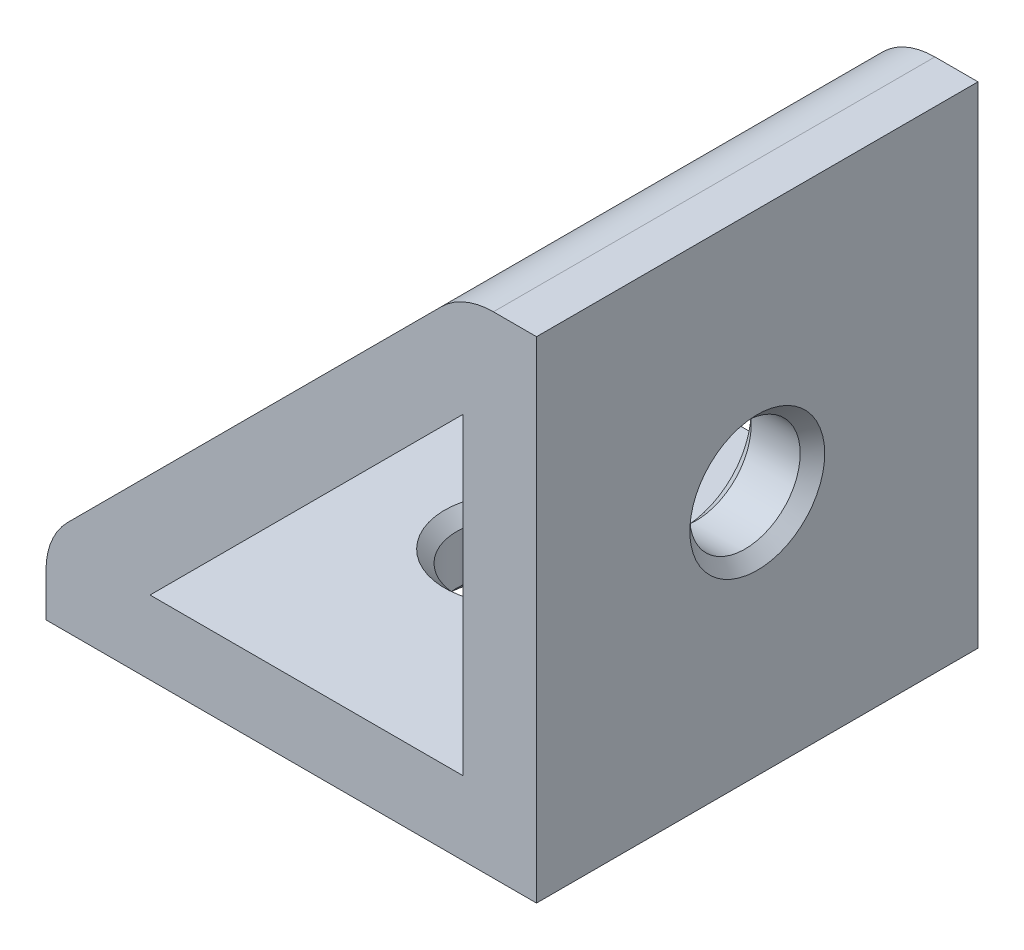
ISO-10303-21;
HEADER;
FILE_DESCRIPTION(('STEP AP214'),'2;1');
FILE_NAME('part.step','',(''),(''),'','','');
FILE_SCHEMA(('AUTOMOTIVE_DESIGN { 1 0 10303 214 1 1 1 1 }'));
ENDSEC;
DATA;
#1=APPLICATION_CONTEXT('core data for automotive mechanical design processes');
#2=APPLICATION_PROTOCOL_DEFINITION('international standard','automotive_design',2000,#1);
#3=PRODUCT_CONTEXT('',#1,'mechanical');
#4=PRODUCT('Part','Part','',(#3));
#5=PRODUCT_RELATED_PRODUCT_CATEGORY('part','',(#4));
#6=PRODUCT_DEFINITION_FORMATION('','',#4);
#7=PRODUCT_DEFINITION_CONTEXT('part definition',#1,'design');
#8=PRODUCT_DEFINITION('design','',#6,#7);
#9=PRODUCT_DEFINITION_SHAPE('','',#8);
#10=(LENGTH_UNIT() NAMED_UNIT(*) SI_UNIT(.MILLI.,.METRE.));
#11=(NAMED_UNIT(*) PLANE_ANGLE_UNIT() SI_UNIT($,.RADIAN.));
#12=(NAMED_UNIT(*) SI_UNIT($,.STERADIAN.) SOLID_ANGLE_UNIT());
#13=UNCERTAINTY_MEASURE_WITH_UNIT(LENGTH_MEASURE(1.E-05),#10,'distance_accuracy_value','');
#14=(GEOMETRIC_REPRESENTATION_CONTEXT(3) GLOBAL_UNCERTAINTY_ASSIGNED_CONTEXT((#13)) GLOBAL_UNIT_ASSIGNED_CONTEXT((#10,
#11,#12)) REPRESENTATION_CONTEXT('',''));
#15=CARTESIAN_POINT('',(0.,0.,0.));
#16=DIRECTION('',(0.,0.,1.));
#17=DIRECTION('',(1.,0.,0.));
#18=AXIS2_PLACEMENT_3D('',#15,#16,#17);
#19=CARTESIAN_POINT('',(-40.,0.,-36.));
#20=DIRECTION('',(0.,-1.,0.));
#21=DIRECTION('',(0.,0.,-1.));
#22=AXIS2_PLACEMENT_3D('',#19,#20,#21);
#23=PLANE('',#22);
#24=CARTESIAN_POINT('',(-20.,0.,-18.));
#25=DIRECTION('',(0.,-1.,0.));
#26=DIRECTION('',(0.,0.,-1.));
#27=AXIS2_PLACEMENT_3D('',#24,#25,#26);
#28=CIRCLE('',#27,5.5);
#29=CARTESIAN_POINT('',(-20.,0.,-23.5));
#30=VERTEX_POINT('',#29);
#31=EDGE_CURVE('E248',#30,#30,#28,.F.);
#32=ORIENTED_EDGE('',*,*,#31,.T.);
#33=EDGE_LOOP('',(#32));
#34=FACE_BOUND('',#33,.T.);
#35=DIRECTION('',(1.,0.,0.));
#36=VECTOR('',#35,1.);
#37=CARTESIAN_POINT('',(-40.,0.,0.));
#38=LINE('',#37,#36);
#39=CARTESIAN_POINT('',(-40.,0.,0.));
#40=VERTEX_POINT('',#39);
#41=CARTESIAN_POINT('',(0.,0.,0.));
#42=VERTEX_POINT('',#41);
#43=EDGE_CURVE('E182',#40,#42,#38,.T.);
#44=ORIENTED_EDGE('',*,*,#43,.F.);
#45=DIRECTION('',(0.,0.,1.));
#46=VECTOR('',#45,1.);
#47=CARTESIAN_POINT('',(-40.,0.,-36.));
#48=LINE('',#47,#46);
#49=CARTESIAN_POINT('',(-40.,0.,-36.));
#50=VERTEX_POINT('',#49);
#51=EDGE_CURVE('E212',#50,#40,#48,.T.);
#52=ORIENTED_EDGE('',*,*,#51,.F.);
#53=DIRECTION('',(1.,0.,0.));
#54=VECTOR('',#53,1.);
#55=CARTESIAN_POINT('',(-40.,0.,-36.));
#56=LINE('',#55,#54);
#57=CARTESIAN_POINT('',(0.,0.,-36.));
#58=VERTEX_POINT('',#57);
#59=EDGE_CURVE('E184',#50,#58,#56,.T.);
#60=ORIENTED_EDGE('',*,*,#59,.T.);
#61=DIRECTION('',(0.,0.,1.));
#62=VECTOR('',#61,1.);
#63=CARTESIAN_POINT('',(0.,0.,-36.));
#64=LINE('',#63,#62);
#65=EDGE_CURVE('E199',#58,#42,#64,.T.);
#66=ORIENTED_EDGE('',*,*,#65,.T.);
#67=EDGE_LOOP('',(#44,#52,#60,#66));
#68=FACE_BOUND('',#67,.T.);
#69=ADVANCED_FACE('F16',(#34,#68),#23,.T.);
#70=CARTESIAN_POINT('',(-40.,0.,-36.));
#71=DIRECTION('',(-1.,0.,0.));
#72=DIRECTION('',(0.,0.,1.));
#73=AXIS2_PLACEMENT_3D('',#70,#71,#72);
#74=PLANE('',#73);
#75=DIRECTION('',(0.,-1.,0.));
#76=VECTOR('',#75,1.);
#77=CARTESIAN_POINT('',(-40.,0.,0.));
#78=LINE('',#77,#76);
#79=CARTESIAN_POINT('',(-40.,3.51471862576143,0.));
#80=VERTEX_POINT('',#79);
#81=EDGE_CURVE('E188',#80,#40,#78,.T.);
#82=ORIENTED_EDGE('',*,*,#81,.F.);
#83=DIRECTION('',(0.,0.,1.));
#84=VECTOR('',#83,1.);
#85=CARTESIAN_POINT('',(-40.,3.51471862576143,-36.));
#86=LINE('',#85,#84);
#87=CARTESIAN_POINT('',(-40.,3.51471862576143,-36.));
#88=VERTEX_POINT('',#87);
#89=EDGE_CURVE('E234',#80,#88,#86,.F.);
#90=ORIENTED_EDGE('',*,*,#89,.T.);
#91=DIRECTION('',(0.,-1.,0.));
#92=VECTOR('',#91,1.);
#93=CARTESIAN_POINT('',(-40.,0.,-36.));
#94=LINE('',#93,#92);
#95=EDGE_CURVE('E197',#88,#50,#94,.T.);
#96=ORIENTED_EDGE('',*,*,#95,.T.);
#97=ORIENTED_EDGE('',*,*,#51,.T.);
#98=EDGE_LOOP('',(#82,#90,#96,#97));
#99=FACE_BOUND('',#98,.T.);
#100=ADVANCED_FACE('F374',(#99),#74,.T.);
#101=CARTESIAN_POINT('',(-40.,6.,-36.));
#102=DIRECTION('',(-0.707106781186547,0.707106781186547,0.));
#103=DIRECTION('',(-0.707106781186548,-0.707106781186548,0.));
#104=AXIS2_PLACEMENT_3D('',#101,#102,#103);
#105=PLANE('',#104);
#106=DIRECTION('',(0.707106781186548,0.707106781186548,0.));
#107=VECTOR('',#106,1.);
#108=CARTESIAN_POINT('',(-20.1715728752538,25.8284271247462,-32.));
#109=LINE('',#108,#107);
#110=CARTESIAN_POINT('',(-25.8284271247462,20.1715728752538,-32.));
#111=VERTEX_POINT('',#110);
#112=CARTESIAN_POINT('',(-20.1715728752538,25.8284271247462,-32.));
#113=VERTEX_POINT('',#112);
#114=EDGE_CURVE('E295',#111,#113,#109,.T.);
#115=ORIENTED_EDGE('',*,*,#114,.T.);
#116=CARTESIAN_POINT('',(-20.1715728752538,25.8284271247462,-18.));
#117=DIRECTION('',(-0.707106781186547,0.707106781186547,0.));
#118=DIRECTION('',(-0.707106781186548,-0.707106781186548,0.));
#119=AXIS2_PLACEMENT_3D('',#116,#117,#118);
#120=CIRCLE('',#119,14.);
#121=CARTESIAN_POINT('',(-20.1715728752538,25.8284271247462,-4.00000000000002));
#122=VERTEX_POINT('',#121);
#123=EDGE_CURVE('E297',#113,#122,#120,.F.);
#124=ORIENTED_EDGE('',*,*,#123,.T.);
#125=DIRECTION('',(-0.707106781186548,-0.707106781186548,0.));
#126=VECTOR('',#125,1.);
#127=CARTESIAN_POINT('',(-25.8284271247462,20.1715728752538,-4.00000000000002));
#128=LINE('',#127,#126);
#129=CARTESIAN_POINT('',(-25.8284271247462,20.1715728752538,-4.00000000000002));
#130=VERTEX_POINT('',#129);
#131=EDGE_CURVE('E293',#122,#130,#128,.T.);
#132=ORIENTED_EDGE('',*,*,#131,.T.);
#133=CARTESIAN_POINT('',(-25.8284271247462,20.1715728752538,-18.));
#134=DIRECTION('',(-0.707106781186547,0.707106781186547,0.));
#135=DIRECTION('',(-0.707106781186548,-0.707106781186548,0.));
#136=AXIS2_PLACEMENT_3D('',#133,#134,#135);
#137=CIRCLE('',#136,14.);
#138=EDGE_CURVE('E291',#130,#111,#137,.F.);
#139=ORIENTED_EDGE('',*,*,#138,.T.);
#140=EDGE_LOOP('',(#115,#124,#132,#139));
#141=FACE_BOUND('',#140,.T.);
#142=DIRECTION('',(-0.707106781186547,-0.707106781186547,0.));
#143=VECTOR('',#142,1.);
#144=CARTESIAN_POINT('',(-40.,6.,0.));
#145=LINE('',#144,#143);
#146=CARTESIAN_POINT('',(-7.75735931288072,38.2426406871193,0.));
#147=VERTEX_POINT('',#146);
#148=CARTESIAN_POINT('',(-38.2426406871193,7.75735931288071,0.));
#149=VERTEX_POINT('',#148);
#150=EDGE_CURVE('E208',#147,#149,#145,.T.);
#151=ORIENTED_EDGE('',*,*,#150,.F.);
#152=DIRECTION('',(0.,0.,1.));
#153=VECTOR('',#152,1.);
#154=CARTESIAN_POINT('',(-7.75735931288071,38.2426406871193,-36.));
#155=LINE('',#154,#153);
#156=CARTESIAN_POINT('',(-7.75735931288072,38.2426406871193,-36.));
#157=VERTEX_POINT('',#156);
#158=EDGE_CURVE('E228',#147,#157,#155,.F.);
#159=ORIENTED_EDGE('',*,*,#158,.T.);
#160=DIRECTION('',(-0.707106781186547,-0.707106781186547,0.));
#161=VECTOR('',#160,1.);
#162=CARTESIAN_POINT('',(-40.,6.,-36.));
#163=LINE('',#162,#161);
#164=CARTESIAN_POINT('',(-38.2426406871193,7.75735931288071,-36.));
#165=VERTEX_POINT('',#164);
#166=EDGE_CURVE('E194',#157,#165,#163,.T.);
#167=ORIENTED_EDGE('',*,*,#166,.T.);
#168=DIRECTION('',(0.,0.,1.));
#169=VECTOR('',#168,1.);
#170=CARTESIAN_POINT('',(-38.2426406871193,7.75735931288071,-36.));
#171=LINE('',#170,#169);
#172=EDGE_CURVE('E225',#165,#149,#171,.T.);
#173=ORIENTED_EDGE('',*,*,#172,.T.);
#174=EDGE_LOOP('',(#151,#159,#167,#173));
#175=FACE_BOUND('',#174,.T.);
#176=ADVANCED_FACE('F320',(#141,#175),#105,.T.);
#177=CARTESIAN_POINT('',(0.,40.,-36.));
#178=DIRECTION('',(0.,1.,0.));
#179=DIRECTION('',(0.,0.,1.));
#180=AXIS2_PLACEMENT_3D('',#177,#178,#179);
#181=PLANE('',#180);
#182=DIRECTION('',(-1.,0.,0.));
#183=VECTOR('',#182,1.);
#184=CARTESIAN_POINT('',(0.,40.,-36.));
#185=LINE('',#184,#183);
#186=CARTESIAN_POINT('',(0.,40.,-36.));
#187=VERTEX_POINT('',#186);
#188=CARTESIAN_POINT('',(-3.51471862576143,40.,-36.));
#189=VERTEX_POINT('',#188);
#190=EDGE_CURVE('E191',#187,#189,#185,.T.);
#191=ORIENTED_EDGE('',*,*,#190,.T.);
#192=DIRECTION('',(0.,0.,1.));
#193=VECTOR('',#192,1.);
#194=CARTESIAN_POINT('',(-3.51471862576143,40.,-36.));
#195=LINE('',#194,#193);
#196=CARTESIAN_POINT('',(-3.51471862576143,40.,0.));
#197=VERTEX_POINT('',#196);
#198=EDGE_CURVE('E215',#189,#197,#195,.T.);
#199=ORIENTED_EDGE('',*,*,#198,.T.);
#200=DIRECTION('',(-1.,0.,0.));
#201=VECTOR('',#200,1.);
#202=CARTESIAN_POINT('',(0.,40.,0.));
#203=LINE('',#202,#201);
#204=CARTESIAN_POINT('',(0.,40.,0.));
#205=VERTEX_POINT('',#204);
#206=EDGE_CURVE('E205',#205,#197,#203,.T.);
#207=ORIENTED_EDGE('',*,*,#206,.F.);
#208=DIRECTION('',(0.,0.,1.));
#209=VECTOR('',#208,1.);
#210=CARTESIAN_POINT('',(0.,40.,-36.));
#211=LINE('',#210,#209);
#212=EDGE_CURVE('E216',#187,#205,#211,.T.);
#213=ORIENTED_EDGE('',*,*,#212,.F.);
#214=EDGE_LOOP('',(#191,#199,#207,#213));
#215=FACE_BOUND('',#214,.T.);
#216=ADVANCED_FACE('F626',(#215),#181,.T.);
#217=CARTESIAN_POINT('',(0.,0.,-36.));
#218=DIRECTION('',(1.,0.,0.));
#219=DIRECTION('',(0.,0.,-1.));
#220=AXIS2_PLACEMENT_3D('',#217,#218,#219);
#221=PLANE('',#220);
#222=CARTESIAN_POINT('',(0.,20.,-18.));
#223=DIRECTION('',(1.,0.,0.));
#224=DIRECTION('',(0.,0.,-1.));
#225=AXIS2_PLACEMENT_3D('',#222,#223,#224);
#226=CIRCLE('',#225,5.50000000000001);
#227=CARTESIAN_POINT('',(0.,20.,-23.5));
#228=VERTEX_POINT('',#227);
#229=EDGE_CURVE('E242',#228,#228,#226,.F.);
#230=ORIENTED_EDGE('',*,*,#229,.T.);
#231=EDGE_LOOP('',(#230));
#232=FACE_BOUND('',#231,.T.);
#233=DIRECTION('',(0.,1.,0.));
#234=VECTOR('',#233,1.);
#235=CARTESIAN_POINT('',(0.,0.,0.));
#236=LINE('',#235,#234);
#237=EDGE_CURVE('E202',#42,#205,#236,.T.);
#238=ORIENTED_EDGE('',*,*,#237,.F.);
#239=ORIENTED_EDGE('',*,*,#65,.F.);
#240=DIRECTION('',(0.,1.,0.));
#241=VECTOR('',#240,1.);
#242=CARTESIAN_POINT('',(0.,0.,-36.));
#243=LINE('',#242,#241);
#244=EDGE_CURVE('E187',#58,#187,#243,.T.);
#245=ORIENTED_EDGE('',*,*,#244,.T.);
#246=ORIENTED_EDGE('',*,*,#212,.T.);
#247=EDGE_LOOP('',(#238,#239,#245,#246));
#248=FACE_BOUND('',#247,.T.);
#249=ADVANCED_FACE('F385',(#232,#248),#221,.T.);
#250=CARTESIAN_POINT('',(0.,0.,-36.));
#251=DIRECTION('',(0.,0.,1.));
#252=DIRECTION('',(1.,0.,0.));
#253=AXIS2_PLACEMENT_3D('',#250,#251,#252);
#254=PLANE('',#253);
#255=DIRECTION('',(0.,1.,0.));
#256=VECTOR('',#255,1.);
#257=CARTESIAN_POINT('',(-6.,6.,-36.));
#258=LINE('',#257,#256);
#259=CARTESIAN_POINT('',(-6.,6.,-36.));
#260=VERTEX_POINT('',#259);
#261=CARTESIAN_POINT('',(-6.,31.5147186257614,-36.));
#262=VERTEX_POINT('',#261);
#263=EDGE_CURVE('E157',#260,#262,#258,.T.);
#264=ORIENTED_EDGE('',*,*,#263,.T.);
#265=DIRECTION('',(-0.707106781186547,-0.707106781186548,0.));
#266=VECTOR('',#265,1.);
#267=CARTESIAN_POINT('',(-6.,31.5147186257614,-36.));
#268=LINE('',#267,#266);
#269=CARTESIAN_POINT('',(-31.5147186257614,6.,-36.));
#270=VERTEX_POINT('',#269);
#271=EDGE_CURVE('E149',#262,#270,#268,.T.);
#272=ORIENTED_EDGE('',*,*,#271,.T.);
#273=DIRECTION('',(1.,0.,0.));
#274=VECTOR('',#273,1.);
#275=CARTESIAN_POINT('',(-31.5147186257614,6.,-36.));
#276=LINE('',#275,#274);
#277=EDGE_CURVE('E161',#270,#260,#276,.T.);
#278=ORIENTED_EDGE('',*,*,#277,.T.);
#279=EDGE_LOOP('',(#264,#272,#278));
#280=FACE_BOUND('',#279,.T.);
#281=ORIENTED_EDGE('',*,*,#166,.F.);
#282=CARTESIAN_POINT('',(-3.51471862576143,34.,-36.));
#283=DIRECTION('',(0.,0.,1.));
#284=DIRECTION('',(1.,0.,0.));
#285=AXIS2_PLACEMENT_3D('',#282,#283,#284);
#286=CIRCLE('',#285,6.);
#287=EDGE_CURVE('E232',#157,#189,#286,.F.);
#288=ORIENTED_EDGE('',*,*,#287,.T.);
#289=ORIENTED_EDGE('',*,*,#190,.F.);
#290=ORIENTED_EDGE('',*,*,#244,.F.);
#291=ORIENTED_EDGE('',*,*,#59,.F.);
#292=ORIENTED_EDGE('',*,*,#95,.F.);
#293=CARTESIAN_POINT('',(-34.,3.51471862576143,-36.));
#294=DIRECTION('',(0.,0.,1.));
#295=DIRECTION('',(1.,0.,0.));
#296=AXIS2_PLACEMENT_3D('',#293,#294,#295);
#297=CIRCLE('',#296,6.);
#298=EDGE_CURVE('E230',#88,#165,#297,.F.);
#299=ORIENTED_EDGE('',*,*,#298,.T.);
#300=EDGE_LOOP('',(#281,#288,#289,#290,#291,#292,#299));
#301=FACE_BOUND('',#300,.T.);
#302=ADVANCED_FACE('F165',(#280,#301),#254,.F.);
#303=CARTESIAN_POINT('',(0.,0.,0.));
#304=DIRECTION('',(0.,0.,1.));
#305=DIRECTION('',(1.,0.,0.));
#306=AXIS2_PLACEMENT_3D('',#303,#304,#305);
#307=PLANE('',#306);
#308=DIRECTION('',(-0.707106781186547,-0.707106781186548,0.));
#309=VECTOR('',#308,1.);
#310=CARTESIAN_POINT('',(-6.,31.5147186257614,0.));
#311=LINE('',#310,#309);
#312=CARTESIAN_POINT('',(-6.,31.5147186257614,0.));
#313=VERTEX_POINT('',#312);
#314=CARTESIAN_POINT('',(-31.5147186257614,6.,0.));
#315=VERTEX_POINT('',#314);
#316=EDGE_CURVE('E152',#313,#315,#311,.T.);
#317=ORIENTED_EDGE('',*,*,#316,.F.);
#318=DIRECTION('',(0.,1.,0.));
#319=VECTOR('',#318,1.);
#320=CARTESIAN_POINT('',(-6.,6.,0.));
#321=LINE('',#320,#319);
#322=CARTESIAN_POINT('',(-6.,6.,0.));
#323=VERTEX_POINT('',#322);
#324=EDGE_CURVE('E167',#323,#313,#321,.T.);
#325=ORIENTED_EDGE('',*,*,#324,.F.);
#326=DIRECTION('',(1.,0.,0.));
#327=VECTOR('',#326,1.);
#328=CARTESIAN_POINT('',(-31.5147186257614,6.,0.));
#329=LINE('',#328,#327);
#330=EDGE_CURVE('E170',#315,#323,#329,.T.);
#331=ORIENTED_EDGE('',*,*,#330,.F.);
#332=EDGE_LOOP('',(#317,#325,#331));
#333=FACE_BOUND('',#332,.T.);
#334=ORIENTED_EDGE('',*,*,#206,.T.);
#335=CARTESIAN_POINT('',(-3.51471862576143,34.,0.));
#336=DIRECTION('',(0.,0.,1.));
#337=DIRECTION('',(1.,0.,0.));
#338=AXIS2_PLACEMENT_3D('',#335,#336,#337);
#339=CIRCLE('',#338,6.);
#340=EDGE_CURVE('E223',#197,#147,#339,.T.);
#341=ORIENTED_EDGE('',*,*,#340,.T.);
#342=ORIENTED_EDGE('',*,*,#150,.T.);
#343=CARTESIAN_POINT('',(-34.,3.51471862576143,0.));
#344=DIRECTION('',(0.,0.,1.));
#345=DIRECTION('',(1.,0.,0.));
#346=AXIS2_PLACEMENT_3D('',#343,#344,#345);
#347=CIRCLE('',#346,6.);
#348=EDGE_CURVE('E221',#149,#80,#347,.T.);
#349=ORIENTED_EDGE('',*,*,#348,.T.);
#350=ORIENTED_EDGE('',*,*,#81,.T.);
#351=ORIENTED_EDGE('',*,*,#43,.T.);
#352=ORIENTED_EDGE('',*,*,#237,.T.);
#353=EDGE_LOOP('',(#334,#341,#342,#349,#350,#351,#352));
#354=FACE_BOUND('',#353,.T.);
#355=ADVANCED_FACE('F600',(#333,#354),#307,.T.);
#356=CARTESIAN_POINT('',(-6.,31.5147186257614,-36.));
#357=DIRECTION('',(-0.707106781186548,0.707106781186547,0.));
#358=DIRECTION('',(-0.707106781186547,-0.707106781186548,0.));
#359=AXIS2_PLACEMENT_3D('',#356,#357,#358);
#360=PLANE('',#359);
#361=DIRECTION('',(0.707106781186547,0.707106781186548,0.));
#362=VECTOR('',#361,1.);
#363=CARTESIAN_POINT('',(-6.,31.5147186257614,-7.));
#364=LINE('',#363,#362);
#365=CARTESIAN_POINT('',(-21.5857864376269,15.9289321881345,-7.00000000000001));
#366=VERTEX_POINT('',#365);
#367=CARTESIAN_POINT('',(-15.9289321881345,21.5857864376269,-7.));
#368=VERTEX_POINT('',#367);
#369=EDGE_CURVE('E267',#366,#368,#364,.T.);
#370=ORIENTED_EDGE('',*,*,#369,.T.);
#371=CARTESIAN_POINT('',(-15.9289321881345,21.5857864376269,-18.));
#372=DIRECTION('',(-0.707106781186548,0.707106781186547,0.));
#373=DIRECTION('',(-0.707106781186547,-0.707106781186548,0.));
#374=AXIS2_PLACEMENT_3D('',#371,#372,#373);
#375=CIRCLE('',#374,11.);
#376=CARTESIAN_POINT('',(-15.9289321881345,21.5857864376269,-29.));
#377=VERTEX_POINT('',#376);
#378=EDGE_CURVE('E269',#368,#377,#375,.T.);
#379=ORIENTED_EDGE('',*,*,#378,.T.);
#380=DIRECTION('',(-0.707106781186547,-0.707106781186548,0.));
#381=VECTOR('',#380,1.);
#382=CARTESIAN_POINT('',(-6.,31.5147186257614,-29.));
#383=LINE('',#382,#381);
#384=CARTESIAN_POINT('',(-21.5857864376269,15.9289321881345,-29.));
#385=VERTEX_POINT('',#384);
#386=EDGE_CURVE('E265',#377,#385,#383,.T.);
#387=ORIENTED_EDGE('',*,*,#386,.T.);
#388=CARTESIAN_POINT('',(-21.5857864376269,15.9289321881345,-18.));
#389=DIRECTION('',(-0.707106781186548,0.707106781186547,0.));
#390=DIRECTION('',(-0.707106781186547,-0.707106781186548,0.));
#391=AXIS2_PLACEMENT_3D('',#388,#389,#390);
#392=CIRCLE('',#391,11.);
#393=EDGE_CURVE('E263',#385,#366,#392,.T.);
#394=ORIENTED_EDGE('',*,*,#393,.T.);
#395=EDGE_LOOP('',(#370,#379,#387,#394));
#396=FACE_BOUND('',#395,.T.);
#397=ORIENTED_EDGE('',*,*,#316,.T.);
#398=DIRECTION('',(0.,0.,1.));
#399=VECTOR('',#398,1.);
#400=CARTESIAN_POINT('',(-31.5147186257614,6.,-36.));
#401=LINE('',#400,#399);
#402=EDGE_CURVE('E145',#270,#315,#401,.T.);
#403=ORIENTED_EDGE('',*,*,#402,.F.);
#404=ORIENTED_EDGE('',*,*,#271,.F.);
#405=DIRECTION('',(0.,0.,1.));
#406=VECTOR('',#405,1.);
#407=CARTESIAN_POINT('',(-6.,31.5147186257614,-36.));
#408=LINE('',#407,#406);
#409=EDGE_CURVE('E180',#262,#313,#408,.T.);
#410=ORIENTED_EDGE('',*,*,#409,.T.);
#411=EDGE_LOOP('',(#397,#403,#404,#410));
#412=FACE_BOUND('',#411,.T.);
#413=ADVANCED_FACE('F147',(#396,#412),#360,.F.);
#414=CARTESIAN_POINT('',(-6.,6.,-36.));
#415=DIRECTION('',(1.,0.,0.));
#416=DIRECTION('',(0.,1.,0.));
#417=AXIS2_PLACEMENT_3D('',#414,#415,#416);
#418=PLANE('',#417);
#419=CARTESIAN_POINT('',(-6.,20.,-18.));
#420=DIRECTION('',(1.,0.,0.));
#421=DIRECTION('',(0.,1.,0.));
#422=AXIS2_PLACEMENT_3D('',#419,#420,#421);
#423=CIRCLE('',#422,5.50000000000002);
#424=CARTESIAN_POINT('',(-6.,25.5,-18.));
#425=VERTEX_POINT('',#424);
#426=EDGE_CURVE('E245',#425,#425,#423,.T.);
#427=ORIENTED_EDGE('',*,*,#426,.T.);
#428=EDGE_LOOP('',(#427));
#429=FACE_BOUND('',#428,.T.);
#430=ORIENTED_EDGE('',*,*,#324,.T.);
#431=ORIENTED_EDGE('',*,*,#409,.F.);
#432=ORIENTED_EDGE('',*,*,#263,.F.);
#433=DIRECTION('',(0.,0.,1.));
#434=VECTOR('',#433,1.);
#435=CARTESIAN_POINT('',(-6.,6.,-36.));
#436=LINE('',#435,#434);
#437=EDGE_CURVE('E156',#260,#323,#436,.T.);
#438=ORIENTED_EDGE('',*,*,#437,.T.);
#439=EDGE_LOOP('',(#430,#431,#432,#438));
#440=FACE_BOUND('',#439,.T.);
#441=ADVANCED_FACE('F581',(#429,#440),#418,.F.);
#442=CARTESIAN_POINT('',(-31.5147186257614,6.,-36.));
#443=DIRECTION('',(0.,-1.,0.));
#444=DIRECTION('',(0.,0.,-1.));
#445=AXIS2_PLACEMENT_3D('',#442,#443,#444);
#446=PLANE('',#445);
#447=CARTESIAN_POINT('',(-20.,6.,-18.));
#448=DIRECTION('',(0.,-1.,0.));
#449=DIRECTION('',(0.,0.,-1.));
#450=AXIS2_PLACEMENT_3D('',#447,#448,#449);
#451=CIRCLE('',#450,5.50000000000004);
#452=CARTESIAN_POINT('',(-20.,6.,-23.5));
#453=VERTEX_POINT('',#452);
#454=EDGE_CURVE('E257',#453,#453,#451,.T.);
#455=ORIENTED_EDGE('',*,*,#454,.T.);
#456=EDGE_LOOP('',(#455));
#457=FACE_BOUND('',#456,.T.);
#458=ORIENTED_EDGE('',*,*,#330,.T.);
#459=ORIENTED_EDGE('',*,*,#437,.F.);
#460=ORIENTED_EDGE('',*,*,#277,.F.);
#461=ORIENTED_EDGE('',*,*,#402,.T.);
#462=EDGE_LOOP('',(#458,#459,#460,#461));
#463=FACE_BOUND('',#462,.T.);
#464=ADVANCED_FACE('F162',(#457,#463),#446,.F.);
#465=CARTESIAN_POINT('',(-6.,20.,-18.));
#466=DIRECTION('',(1.,0.,0.));
#467=DIRECTION('',(0.,0.,-1.));
#468=AXIS2_PLACEMENT_3D('',#465,#466,#467);
#469=CYLINDRICAL_SURFACE('',#468,4.5);
#470=CARTESIAN_POINT('',(-1.00000000000001,20.,-18.));
#471=DIRECTION('',(1.,0.,0.));
#472=DIRECTION('',(0.,0.,-1.));
#473=AXIS2_PLACEMENT_3D('',#470,#471,#472);
#474=CIRCLE('',#473,4.5);
#475=CARTESIAN_POINT('',(-1.00000000000001,20.,-22.5));
#476=VERTEX_POINT('',#475);
#477=EDGE_CURVE('E239',#476,#476,#474,.T.);
#478=ORIENTED_EDGE('',*,*,#477,.T.);
#479=EDGE_LOOP('',(#478));
#480=FACE_BOUND('',#479,.T.);
#481=CARTESIAN_POINT('',(-4.99999999999998,20.,-18.));
#482=DIRECTION('',(1.,0.,0.));
#483=DIRECTION('',(0.,0.,-1.));
#484=AXIS2_PLACEMENT_3D('',#481,#482,#483);
#485=CIRCLE('',#484,4.5);
#486=CARTESIAN_POINT('',(-4.99999999999998,20.,-22.5));
#487=VERTEX_POINT('',#486);
#488=EDGE_CURVE('E236',#487,#487,#485,.F.);
#489=ORIENTED_EDGE('',*,*,#488,.T.);
#490=EDGE_LOOP('',(#489));
#491=FACE_BOUND('',#490,.T.);
#492=ADVANCED_FACE('F562',(#480,#491),#469,.F.);
#493=CARTESIAN_POINT('',(-20.,5.99999999999999,-18.));
#494=DIRECTION('',(0.,-1.,0.));
#495=DIRECTION('',(1.,0.,0.));
#496=AXIS2_PLACEMENT_3D('',#493,#494,#495);
#497=CYLINDRICAL_SURFACE('',#496,4.5);
#498=CARTESIAN_POINT('',(-20.,1.,-18.));
#499=DIRECTION('',(0.,-1.,0.));
#500=DIRECTION('',(0.,0.,-1.));
#501=AXIS2_PLACEMENT_3D('',#498,#499,#500);
#502=CIRCLE('',#501,4.5);
#503=CARTESIAN_POINT('',(-20.,1.,-22.5));
#504=VERTEX_POINT('',#503);
#505=EDGE_CURVE('E254',#504,#504,#502,.T.);
#506=ORIENTED_EDGE('',*,*,#505,.T.);
#507=EDGE_LOOP('',(#506));
#508=FACE_BOUND('',#507,.T.);
#509=CARTESIAN_POINT('',(-20.,4.99999999999997,-18.));
#510=DIRECTION('',(0.,-1.,0.));
#511=DIRECTION('',(0.,0.,-1.));
#512=AXIS2_PLACEMENT_3D('',#509,#510,#511);
#513=CIRCLE('',#512,4.5);
#514=CARTESIAN_POINT('',(-20.,4.99999999999997,-22.5));
#515=VERTEX_POINT('',#514);
#516=EDGE_CURVE('E251',#515,#515,#513,.F.);
#517=ORIENTED_EDGE('',*,*,#516,.T.);
#518=EDGE_LOOP('',(#517));
#519=FACE_BOUND('',#518,.T.);
#520=ADVANCED_FACE('F553',(#508,#519),#497,.F.);
#521=CARTESIAN_POINT('',(8.40211793305835,-2.74526368356597,-18.));
#522=DIRECTION('',(-0.707106781186548,0.707106781186547,0.));
#523=DIRECTION('',(-0.707106781186547,-0.707106781186548,0.));
#524=AXIS2_PLACEMENT_3D('',#521,#522,#523);
#525=CYLINDRICAL_SURFACE('',#524,9.99999999999999);
#526=DIRECTION('',(-0.707106781186548,0.707106781186547,0.));
#527=VECTOR('',#526,1.);
#528=CARTESIAN_POINT('',(8.40211793305835,-2.74526368356596,-8.));
#529=LINE('',#528,#527);
#530=CARTESIAN_POINT('',(-16.6360389693211,22.2928932188135,-8.));
#531=VERTEX_POINT('',#530);
#532=CARTESIAN_POINT('',(-17.3431457505076,23.,-8.));
#533=VERTEX_POINT('',#532);
#534=EDGE_CURVE('E178',#531,#533,#529,.T.);
#535=ORIENTED_EDGE('',*,*,#534,.T.);
#536=CARTESIAN_POINT('',(-17.3431457505076,23.,-18.));
#537=DIRECTION('',(-0.707106781186547,0.707106781186548,0.));
#538=DIRECTION('',(-0.707106781186548,-0.707106781186547,0.));
#539=AXIS2_PLACEMENT_3D('',#536,#537,#538);
#540=CIRCLE('',#539,9.99999999999999);
#541=CARTESIAN_POINT('',(-17.3431457505076,23.,-28.));
#542=VERTEX_POINT('',#541);
#543=EDGE_CURVE('E278',#533,#542,#540,.T.);
#544=ORIENTED_EDGE('',*,*,#543,.T.);
#545=DIRECTION('',(-0.707106781186548,0.707106781186547,0.));
#546=VECTOR('',#545,1.);
#547=CARTESIAN_POINT('',(8.40211793305835,-2.74526368356596,-28.));
#548=LINE('',#547,#546);
#549=CARTESIAN_POINT('',(-16.6360389693211,22.2928932188135,-28.));
#550=VERTEX_POINT('',#549);
#551=EDGE_CURVE('E173',#550,#542,#548,.T.);
#552=ORIENTED_EDGE('',*,*,#551,.F.);
#553=CARTESIAN_POINT('',(-16.6360389693211,22.2928932188135,-18.));
#554=DIRECTION('',(-0.707106781186549,0.707106781186546,0.));
#555=DIRECTION('',(-0.707106781186546,-0.707106781186549,0.));
#556=AXIS2_PLACEMENT_3D('',#553,#554,#555);
#557=CIRCLE('',#556,9.99999999999999);
#558=EDGE_CURVE('E260',#550,#531,#557,.F.);
#559=ORIENTED_EDGE('',*,*,#558,.T.);
#560=EDGE_LOOP('',(#535,#544,#552,#559));
#561=FACE_BOUND('',#560,.T.);
#562=ADVANCED_FACE('F331',(#561),#525,.F.);
#563=CARTESIAN_POINT('',(8.40211793305835,-2.74526368356596,-8.));
#564=DIRECTION('',(0.,0.,1.));
#565=DIRECTION('',(1.,0.,0.));
#566=AXIS2_PLACEMENT_3D('',#563,#564,#565);
#567=PLANE('',#566);
#568=DIRECTION('',(-0.707106781186548,0.707106781186547,0.));
#569=VECTOR('',#568,1.);
#570=CARTESIAN_POINT('',(2.74526368356597,-8.40211793305834,-8.));
#571=LINE('',#570,#569);
#572=CARTESIAN_POINT('',(-22.2928932188135,16.6360389693211,-8.));
#573=VERTEX_POINT('',#572);
#574=CARTESIAN_POINT('',(-23.,17.3431457505076,-8.));
#575=VERTEX_POINT('',#574);
#576=EDGE_CURVE('E337',#573,#575,#571,.T.);
#577=ORIENTED_EDGE('',*,*,#576,.T.);
#578=DIRECTION('',(0.707106781186548,0.707106781186548,0.));
#579=VECTOR('',#578,1.);
#580=CARTESIAN_POINT('',(-17.3431457505076,23.,-8.));
#581=LINE('',#580,#579);
#582=EDGE_CURVE('E26',#575,#533,#581,.T.);
#583=ORIENTED_EDGE('',*,*,#582,.T.);
#584=ORIENTED_EDGE('',*,*,#534,.F.);
#585=DIRECTION('',(-0.707106781186547,-0.707106781186548,0.));
#586=VECTOR('',#585,1.);
#587=CARTESIAN_POINT('',(-16.6360389693211,22.2928932188135,-8.));
#588=LINE('',#587,#586);
#589=EDGE_CURVE('E272',#531,#573,#588,.T.);
#590=ORIENTED_EDGE('',*,*,#589,.T.);
#591=EDGE_LOOP('',(#577,#583,#584,#590));
#592=FACE_BOUND('',#591,.T.);
#593=ADVANCED_FACE('F341',(#592),#567,.F.);
#594=CARTESIAN_POINT('',(2.74526368356597,-8.40211793305834,-18.));
#595=DIRECTION('',(-0.707106781186548,0.707106781186547,0.));
#596=DIRECTION('',(-0.707106781186547,-0.707106781186548,0.));
#597=AXIS2_PLACEMENT_3D('',#594,#595,#596);
#598=CYLINDRICAL_SURFACE('',#597,9.99999999999999);
#599=DIRECTION('',(-0.707106781186548,0.707106781186547,0.));
#600=VECTOR('',#599,1.);
#601=CARTESIAN_POINT('',(2.74526368356597,-8.40211793305834,-28.));
#602=LINE('',#601,#600);
#603=CARTESIAN_POINT('',(-22.2928932188135,16.6360389693211,-28.));
#604=VERTEX_POINT('',#603);
#605=CARTESIAN_POINT('',(-23.,17.3431457505076,-28.));
#606=VERTEX_POINT('',#605);
#607=EDGE_CURVE('E336',#604,#606,#602,.T.);
#608=ORIENTED_EDGE('',*,*,#607,.T.);
#609=CARTESIAN_POINT('',(-23.,17.3431457505076,-18.));
#610=DIRECTION('',(-0.707106781186548,0.707106781186548,0.));
#611=DIRECTION('',(-0.707106781186548,-0.707106781186548,0.));
#612=AXIS2_PLACEMENT_3D('',#609,#610,#611);
#613=CIRCLE('',#612,9.99999999999999);
#614=EDGE_CURVE('E10',#606,#575,#613,.T.);
#615=ORIENTED_EDGE('',*,*,#614,.T.);
#616=ORIENTED_EDGE('',*,*,#576,.F.);
#617=CARTESIAN_POINT('',(-22.2928932188135,16.6360389693211,-18.));
#618=DIRECTION('',(-0.707106781186548,0.707106781186548,0.));
#619=DIRECTION('',(-0.707106781186548,-0.707106781186548,0.));
#620=AXIS2_PLACEMENT_3D('',#617,#618,#619);
#621=CIRCLE('',#620,9.99999999999999);
#622=EDGE_CURVE('E276',#573,#604,#621,.F.);
#623=ORIENTED_EDGE('',*,*,#622,.T.);
#624=EDGE_LOOP('',(#608,#615,#616,#623));
#625=FACE_BOUND('',#624,.T.);
#626=ADVANCED_FACE('F344',(#625),#598,.F.);
#627=CARTESIAN_POINT('',(8.40211793305835,-2.74526368356596,-28.));
#628=DIRECTION('',(0.,0.,-1.));
#629=DIRECTION('',(-1.,0.,0.));
#630=AXIS2_PLACEMENT_3D('',#627,#628,#629);
#631=PLANE('',#630);
#632=ORIENTED_EDGE('',*,*,#551,.T.);
#633=DIRECTION('',(-0.707106781186548,-0.707106781186548,0.));
#634=VECTOR('',#633,1.);
#635=CARTESIAN_POINT('',(-23.,17.3431457505076,-28.));
#636=LINE('',#635,#634);
#637=EDGE_CURVE('E40',#542,#606,#636,.T.);
#638=ORIENTED_EDGE('',*,*,#637,.T.);
#639=ORIENTED_EDGE('',*,*,#607,.F.);
#640=DIRECTION('',(0.707106781186547,0.707106781186548,0.));
#641=VECTOR('',#640,1.);
#642=CARTESIAN_POINT('',(-16.6360389693211,22.2928932188135,-28.));
#643=LINE('',#642,#641);
#644=EDGE_CURVE('E274',#604,#550,#643,.T.);
#645=ORIENTED_EDGE('',*,*,#644,.T.);
#646=EDGE_LOOP('',(#632,#638,#639,#645));
#647=FACE_BOUND('',#646,.T.);
#648=ADVANCED_FACE('F334',(#647),#631,.F.);
#649=CARTESIAN_POINT('',(-3.51471862576143,34.,-36.));
#650=DIRECTION('',(0.,0.,1.));
#651=DIRECTION('',(1.,0.,0.));
#652=AXIS2_PLACEMENT_3D('',#649,#650,#651);
#653=CYLINDRICAL_SURFACE('',#652,6.);
#654=ORIENTED_EDGE('',*,*,#287,.F.);
#655=ORIENTED_EDGE('',*,*,#158,.F.);
#656=ORIENTED_EDGE('',*,*,#340,.F.);
#657=ORIENTED_EDGE('',*,*,#198,.F.);
#658=EDGE_LOOP('',(#654,#655,#656,#657));
#659=FACE_BOUND('',#658,.T.);
#660=ADVANCED_FACE('F387',(#659),#653,.T.);
#661=CARTESIAN_POINT('',(-34.,3.51471862576143,-36.));
#662=DIRECTION('',(0.,0.,1.));
#663=DIRECTION('',(1.,0.,0.));
#664=AXIS2_PLACEMENT_3D('',#661,#662,#663);
#665=CYLINDRICAL_SURFACE('',#664,6.);
#666=ORIENTED_EDGE('',*,*,#298,.F.);
#667=ORIENTED_EDGE('',*,*,#89,.F.);
#668=ORIENTED_EDGE('',*,*,#348,.F.);
#669=ORIENTED_EDGE('',*,*,#172,.F.);
#670=EDGE_LOOP('',(#666,#667,#668,#669));
#671=FACE_BOUND('',#670,.T.);
#672=ADVANCED_FACE('F390',(#671),#665,.T.);
#673=CARTESIAN_POINT('',(-1.00000000000001,20.,-18.));
#674=DIRECTION('',(1.,0.,0.));
#675=DIRECTION('',(0.,0.,-1.));
#676=AXIS2_PLACEMENT_3D('',#673,#674,#675);
#677=CONICAL_SURFACE('',#676,4.5,0.785398163397447);
#678=ORIENTED_EDGE('',*,*,#229,.F.);
#679=EDGE_LOOP('',(#678));
#680=FACE_BOUND('',#679,.T.);
#681=ORIENTED_EDGE('',*,*,#477,.F.);
#682=EDGE_LOOP('',(#681));
#683=FACE_BOUND('',#682,.T.);
#684=ADVANCED_FACE('F394',(#680,#683),#677,.F.);
#685=CARTESIAN_POINT('',(-6.,20.,-18.));
#686=DIRECTION('',(-1.,0.,0.));
#687=DIRECTION('',(0.,0.,1.));
#688=AXIS2_PLACEMENT_3D('',#685,#686,#687);
#689=CONICAL_SURFACE('',#688,5.50000000000002,0.785398163397449);
#690=ORIENTED_EDGE('',*,*,#488,.F.);
#691=EDGE_LOOP('',(#690));
#692=FACE_BOUND('',#691,.T.);
#693=ORIENTED_EDGE('',*,*,#426,.F.);
#694=EDGE_LOOP('',(#693));
#695=FACE_BOUND('',#694,.T.);
#696=ADVANCED_FACE('F403',(#692,#695),#689,.F.);
#697=CARTESIAN_POINT('',(-20.,0.,-18.));
#698=DIRECTION('',(0.,-1.,0.));
#699=DIRECTION('',(0.,0.,-1.));
#700=AXIS2_PLACEMENT_3D('',#697,#698,#699);
#701=CONICAL_SURFACE('',#700,5.5,0.785398163397445);
#702=ORIENTED_EDGE('',*,*,#505,.F.);
#703=EDGE_LOOP('',(#702));
#704=FACE_BOUND('',#703,.T.);
#705=ORIENTED_EDGE('',*,*,#31,.F.);
#706=EDGE_LOOP('',(#705));
#707=FACE_BOUND('',#706,.T.);
#708=ADVANCED_FACE('F410',(#704,#707),#701,.F.);
#709=CARTESIAN_POINT('',(-20.,4.99999999999997,-18.));
#710=DIRECTION('',(0.,1.,0.));
#711=DIRECTION('',(0.,0.,1.));
#712=AXIS2_PLACEMENT_3D('',#709,#710,#711);
#713=CONICAL_SURFACE('',#712,4.5,0.78539816339745);
#714=ORIENTED_EDGE('',*,*,#454,.F.);
#715=EDGE_LOOP('',(#714));
#716=FACE_BOUND('',#715,.T.);
#717=ORIENTED_EDGE('',*,*,#516,.F.);
#718=EDGE_LOOP('',(#717));
#719=FACE_BOUND('',#718,.T.);
#720=ADVANCED_FACE('F370',(#716,#719),#713,.F.);
#721=CARTESIAN_POINT('',(-22.2928932188135,16.6360389693211,-18.));
#722=DIRECTION('',(0.707106781186548,-0.707106781186548,0.));
#723=DIRECTION('',(0.707106781186548,0.707106781186548,0.));
#724=AXIS2_PLACEMENT_3D('',#721,#722,#723);
#725=CONICAL_SURFACE('',#724,9.99999999999999,0.785398163397446);
#726=DIRECTION('',(-0.5,0.5,-0.707106781186547));
#727=VECTOR('',#726,1.);
#728=CARTESIAN_POINT('',(-21.5857864376269,15.9289321881345,-7.00000000000001));
#729=LINE('',#728,#727);
#730=EDGE_CURVE('E283',#366,#573,#729,.T.);
#731=ORIENTED_EDGE('',*,*,#730,.F.);
#732=ORIENTED_EDGE('',*,*,#393,.F.);
#733=DIRECTION('',(0.5,-0.5,-0.707106781186547));
#734=VECTOR('',#733,1.);
#735=CARTESIAN_POINT('',(-22.2928932188135,16.6360389693211,-28.));
#736=LINE('',#735,#734);
#737=EDGE_CURVE('E286',#604,#385,#736,.T.);
#738=ORIENTED_EDGE('',*,*,#737,.F.);
#739=ORIENTED_EDGE('',*,*,#622,.F.);
#740=EDGE_LOOP('',(#731,#732,#738,#739));
#741=FACE_BOUND('',#740,.T.);
#742=ADVANCED_FACE('F348',(#741),#725,.F.);
#743=CARTESIAN_POINT('',(-16.6360389693211,22.2928932188135,-28.));
#744=DIRECTION('',(-0.5,0.5,-0.707106781186548));
#745=DIRECTION('',(0.707106781186547,0.707106781186548,0.));
#746=AXIS2_PLACEMENT_3D('',#743,#744,#745);
#747=PLANE('',#746);
#748=ORIENTED_EDGE('',*,*,#737,.T.);
#749=ORIENTED_EDGE('',*,*,#386,.F.);
#750=DIRECTION('',(0.5,-0.500000000000002,-0.707106781186546));
#751=VECTOR('',#750,1.);
#752=CARTESIAN_POINT('',(-16.6360389693211,22.2928932188135,-28.));
#753=LINE('',#752,#751);
#754=EDGE_CURVE('E281',#550,#377,#753,.T.);
#755=ORIENTED_EDGE('',*,*,#754,.F.);
#756=ORIENTED_EDGE('',*,*,#644,.F.);
#757=EDGE_LOOP('',(#748,#749,#755,#756));
#758=FACE_BOUND('',#757,.T.);
#759=ADVANCED_FACE('F361',(#758),#747,.F.);
#760=CARTESIAN_POINT('',(-16.6360389693211,22.2928932188135,-8.));
#761=DIRECTION('',(-0.5,0.5,0.707106781186547));
#762=DIRECTION('',(-0.707106781186547,-0.707106781186548,0.));
#763=AXIS2_PLACEMENT_3D('',#760,#761,#762);
#764=PLANE('',#763);
#765=ORIENTED_EDGE('',*,*,#730,.T.);
#766=ORIENTED_EDGE('',*,*,#589,.F.);
#767=DIRECTION('',(-0.500000000000001,0.500000000000001,-0.707106781186546));
#768=VECTOR('',#767,1.);
#769=CARTESIAN_POINT('',(-15.9289321881345,21.5857864376269,-7.));
#770=LINE('',#769,#768);
#771=EDGE_CURVE('E279',#368,#531,#770,.T.);
#772=ORIENTED_EDGE('',*,*,#771,.F.);
#773=ORIENTED_EDGE('',*,*,#369,.F.);
#774=EDGE_LOOP('',(#765,#766,#772,#773));
#775=FACE_BOUND('',#774,.T.);
#776=ADVANCED_FACE('F352',(#775),#764,.F.);
#777=CARTESIAN_POINT('',(-16.6360389693211,22.2928932188135,-18.));
#778=DIRECTION('',(0.707106781186549,-0.707106781186546,0.));
#779=DIRECTION('',(0.707106781186546,0.707106781186549,0.));
#780=AXIS2_PLACEMENT_3D('',#777,#778,#779);
#781=CONICAL_SURFACE('',#780,9.99999999999999,0.785398163397444);
#782=ORIENTED_EDGE('',*,*,#754,.T.);
#783=ORIENTED_EDGE('',*,*,#378,.F.);
#784=ORIENTED_EDGE('',*,*,#771,.T.);
#785=ORIENTED_EDGE('',*,*,#558,.F.);
#786=EDGE_LOOP('',(#782,#783,#784,#785));
#787=FACE_BOUND('',#786,.T.);
#788=ADVANCED_FACE('F357',(#787),#781,.F.);
#789=CARTESIAN_POINT('',(-23.,17.3431457505076,-18.));
#790=DIRECTION('',(-0.707106781186548,0.707106781186548,0.));
#791=DIRECTION('',(-0.707106781186548,-0.707106781186548,0.));
#792=AXIS2_PLACEMENT_3D('',#789,#790,#791);
#793=CONICAL_SURFACE('',#792,9.99999999999999,0.785398163397449);
#794=DIRECTION('',(0.5,-0.5,0.707106781186548));
#795=VECTOR('',#794,1.);
#796=CARTESIAN_POINT('',(-25.8284271247462,20.1715728752538,-32.));
#797=LINE('',#796,#795);
#798=EDGE_CURVE('E305',#111,#606,#797,.T.);
#799=ORIENTED_EDGE('',*,*,#798,.F.);
#800=ORIENTED_EDGE('',*,*,#138,.F.);
#801=DIRECTION('',(-0.5,0.499999999999999,0.707106781186548));
#802=VECTOR('',#801,1.);
#803=CARTESIAN_POINT('',(-23.,17.3431457505076,-8.00000000000001));
#804=LINE('',#803,#802);
#805=EDGE_CURVE('E21',#575,#130,#804,.T.);
#806=ORIENTED_EDGE('',*,*,#805,.F.);
#807=ORIENTED_EDGE('',*,*,#614,.F.);
#808=EDGE_LOOP('',(#799,#800,#806,#807));
#809=FACE_BOUND('',#808,.T.);
#810=ADVANCED_FACE('F19',(#809),#793,.F.);
#811=CARTESIAN_POINT('',(-17.3431457505076,23.,-8.));
#812=DIRECTION('',(-0.500000000000001,0.500000000000001,-0.707106781186546));
#813=DIRECTION('',(-0.707106781186548,-0.707106781186548,0.));
#814=AXIS2_PLACEMENT_3D('',#811,#812,#813);
#815=PLANE('',#814);
#816=ORIENTED_EDGE('',*,*,#805,.T.);
#817=ORIENTED_EDGE('',*,*,#131,.F.);
#818=DIRECTION('',(-0.499999999999999,0.499999999999999,0.707106781186549));
#819=VECTOR('',#818,1.);
#820=CARTESIAN_POINT('',(-17.3431457505076,23.,-8.));
#821=LINE('',#820,#819);
#822=EDGE_CURVE('E304',#533,#122,#821,.T.);
#823=ORIENTED_EDGE('',*,*,#822,.F.);
#824=ORIENTED_EDGE('',*,*,#582,.F.);
#825=EDGE_LOOP('',(#816,#817,#823,#824));
#826=FACE_BOUND('',#825,.T.);
#827=ADVANCED_FACE('F315',(#826),#815,.T.);
#828=CARTESIAN_POINT('',(-17.3431457505076,23.,-28.));
#829=DIRECTION('',(-0.500000000000001,0.500000000000001,0.707106781186547));
#830=DIRECTION('',(0.707106781186548,0.707106781186548,0.));
#831=AXIS2_PLACEMENT_3D('',#828,#829,#830);
#832=PLANE('',#831);
#833=ORIENTED_EDGE('',*,*,#798,.T.);
#834=ORIENTED_EDGE('',*,*,#637,.F.);
#835=DIRECTION('',(0.499999999999999,-0.5,0.707106781186549));
#836=VECTOR('',#835,1.);
#837=CARTESIAN_POINT('',(-20.1715728752538,25.8284271247462,-32.));
#838=LINE('',#837,#836);
#839=EDGE_CURVE('E302',#113,#542,#838,.T.);
#840=ORIENTED_EDGE('',*,*,#839,.F.);
#841=ORIENTED_EDGE('',*,*,#114,.F.);
#842=EDGE_LOOP('',(#833,#834,#840,#841));
#843=FACE_BOUND('',#842,.T.);
#844=ADVANCED_FACE('F327',(#843),#832,.T.);
#845=CARTESIAN_POINT('',(-17.3431457505076,23.,-18.));
#846=DIRECTION('',(-0.707106781186547,0.707106781186548,0.));
#847=DIRECTION('',(-0.707106781186548,-0.707106781186547,0.));
#848=AXIS2_PLACEMENT_3D('',#845,#846,#847);
#849=CONICAL_SURFACE('',#848,9.99999999999999,0.785398163397451);
#850=ORIENTED_EDGE('',*,*,#822,.T.);
#851=ORIENTED_EDGE('',*,*,#123,.F.);
#852=ORIENTED_EDGE('',*,*,#839,.T.);
#853=ORIENTED_EDGE('',*,*,#543,.F.);
#854=EDGE_LOOP('',(#850,#851,#852,#853));
#855=FACE_BOUND('',#854,.T.);
#856=ADVANCED_FACE('F325',(#855),#849,.F.);
#857=CLOSED_SHELL('',(#69,#100,#176,#216,#249,#302,#355,#413,#441,#464,#492,#520,#562,#593,#626,
#648,#660,#672,#684,#696,#708,#720,#742,#759,#776,#788,#810,#827,#844,#856));
#858=MANIFOLD_SOLID_BREP('B1',#857);
#859=ADVANCED_BREP_SHAPE_REPRESENTATION('',(#18,#858),#14);
#860=SHAPE_DEFINITION_REPRESENTATION(#9,#859);
ENDSEC;
END-ISO-10303-21;
